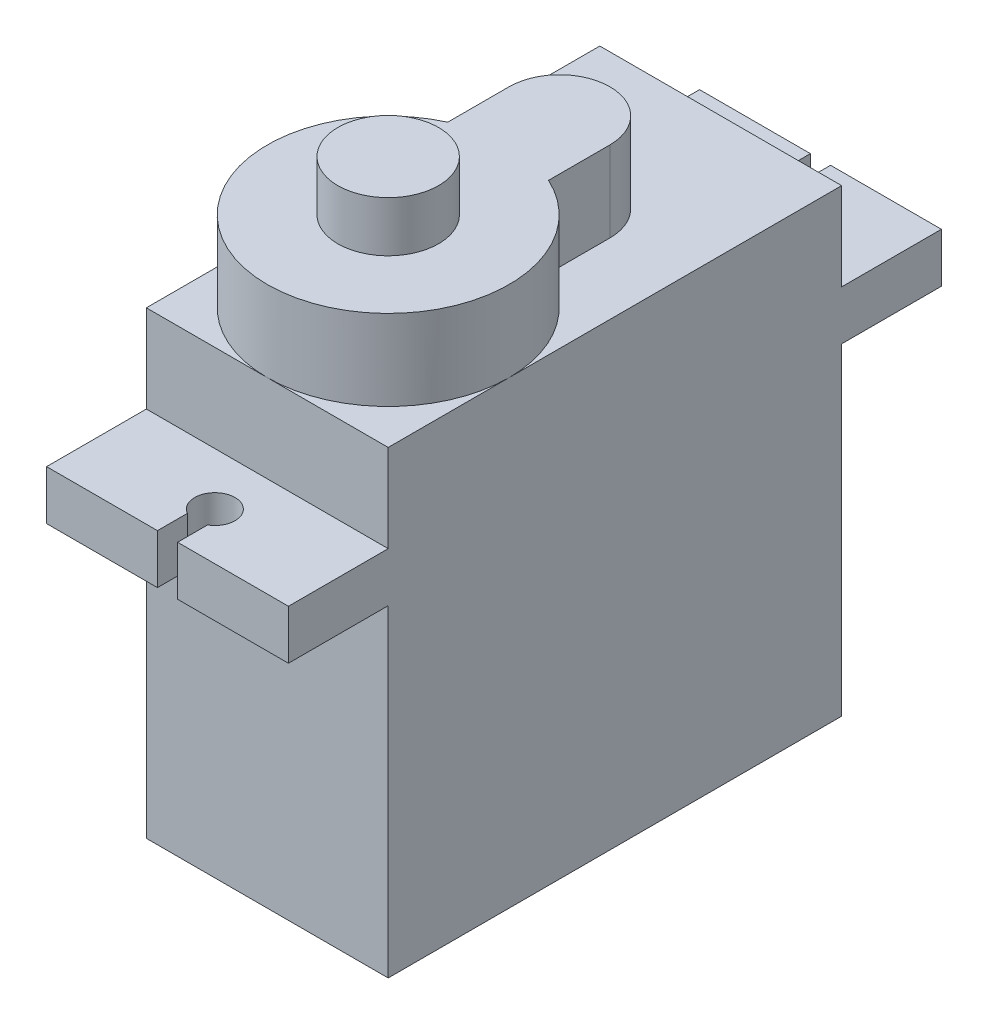
ISO-10303-21;
HEADER;
FILE_DESCRIPTION(('STEP AP214'),'2;1');
FILE_NAME('part.step','',(''),(''),'','','');
FILE_SCHEMA(('AUTOMOTIVE_DESIGN { 1 0 10303 214 1 1 1 1 }'));
ENDSEC;
DATA;
#1=APPLICATION_CONTEXT('core data for automotive mechanical design processes');
#2=APPLICATION_PROTOCOL_DEFINITION('international standard','automotive_design',2000,#1);
#3=PRODUCT_CONTEXT('',#1,'mechanical');
#4=PRODUCT('Part','Part','',(#3));
#5=PRODUCT_RELATED_PRODUCT_CATEGORY('part','',(#4));
#6=PRODUCT_DEFINITION_FORMATION('','',#4);
#7=PRODUCT_DEFINITION_CONTEXT('part definition',#1,'design');
#8=PRODUCT_DEFINITION('design','',#6,#7);
#9=PRODUCT_DEFINITION_SHAPE('','',#8);
#10=(LENGTH_UNIT() NAMED_UNIT(*) SI_UNIT(.MILLI.,.METRE.));
#11=(NAMED_UNIT(*) PLANE_ANGLE_UNIT() SI_UNIT($,.RADIAN.));
#12=(NAMED_UNIT(*) SI_UNIT($,.STERADIAN.) SOLID_ANGLE_UNIT());
#13=UNCERTAINTY_MEASURE_WITH_UNIT(LENGTH_MEASURE(1.E-05),#10,'distance_accuracy_value','');
#14=(GEOMETRIC_REPRESENTATION_CONTEXT(3) GLOBAL_UNCERTAINTY_ASSIGNED_CONTEXT((#13)) GLOBAL_UNIT_ASSIGNED_CONTEXT((#10,
#11,#12)) REPRESENTATION_CONTEXT('',''));
#15=CARTESIAN_POINT('',(0.,0.,0.));
#16=DIRECTION('',(0.,0.,1.));
#17=DIRECTION('',(1.,0.,0.));
#18=AXIS2_PLACEMENT_3D('',#15,#16,#17);
#19=CARTESIAN_POINT('',(12.,22.8,11.25));
#20=DIRECTION('',(0.,-1.,0.));
#21=DIRECTION('',(0.,0.,-1.));
#22=AXIS2_PLACEMENT_3D('',#19,#20,#21);
#23=PLANE('',#22);
#24=CARTESIAN_POINT('',(6.,22.8,5.25));
#25=DIRECTION('',(0.,1.,0.));
#26=DIRECTION('',(0.,0.,1.));
#27=AXIS2_PLACEMENT_3D('',#24,#25,#26);
#28=CIRCLE('',#27,6.);
#29=CARTESIAN_POINT('',(3.5,22.8,-0.204356057317862));
#30=VERTEX_POINT('',#29);
#31=CARTESIAN_POINT('',(0.,22.8,5.25));
#32=VERTEX_POINT('',#31);
#33=EDGE_CURVE('E48',#30,#32,#28,.T.);
#34=ORIENTED_EDGE('',*,*,#33,.F.);
#35=DIRECTION('',(0.,0.,1.));
#36=VECTOR('',#35,1.);
#37=CARTESIAN_POINT('',(3.5,22.8,-3.25));
#38=LINE('',#37,#36);
#39=CARTESIAN_POINT('',(3.5,22.8,-3.25));
#40=VERTEX_POINT('',#39);
#41=EDGE_CURVE('E58',#40,#30,#38,.T.);
#42=ORIENTED_EDGE('',*,*,#41,.F.);
#43=CARTESIAN_POINT('',(6.,22.8,-3.25));
#44=DIRECTION('',(0.,1.,0.));
#45=DIRECTION('',(0.,0.,1.));
#46=AXIS2_PLACEMENT_3D('',#43,#44,#45);
#47=CIRCLE('',#46,2.5);
#48=CARTESIAN_POINT('',(8.5,22.8,-3.25));
#49=VERTEX_POINT('',#48);
#50=EDGE_CURVE('E390',#49,#40,#47,.T.);
#51=ORIENTED_EDGE('',*,*,#50,.F.);
#52=DIRECTION('',(0.,0.,-1.));
#53=VECTOR('',#52,1.);
#54=CARTESIAN_POINT('',(8.5,22.8,-0.204356057317862));
#55=LINE('',#54,#53);
#56=CARTESIAN_POINT('',(8.5,22.8,-0.204356057317862));
#57=VERTEX_POINT('',#56);
#58=EDGE_CURVE('E388',#57,#49,#55,.T.);
#59=ORIENTED_EDGE('',*,*,#58,.F.);
#60=CARTESIAN_POINT('',(12.,22.8,5.25));
#61=VERTEX_POINT('',#60);
#62=EDGE_CURVE('E232',#61,#57,#28,.T.);
#63=ORIENTED_EDGE('',*,*,#62,.F.);
#64=DIRECTION('',(0.,0.,1.));
#65=VECTOR('',#64,1.);
#66=CARTESIAN_POINT('',(12.,22.8,0.));
#67=LINE('',#66,#65);
#68=CARTESIAN_POINT('',(12.,22.8,-11.25));
#69=VERTEX_POINT('',#68);
#70=EDGE_CURVE('E297',#69,#61,#67,.T.);
#71=ORIENTED_EDGE('',*,*,#70,.F.);
#72=DIRECTION('',(-1.,0.,0.));
#73=VECTOR('',#72,1.);
#74=CARTESIAN_POINT('',(12.,22.8,-11.25));
#75=LINE('',#74,#73);
#76=CARTESIAN_POINT('',(0.,22.8,-11.25));
#77=VERTEX_POINT('',#76);
#78=EDGE_CURVE('E360',#69,#77,#75,.T.);
#79=ORIENTED_EDGE('',*,*,#78,.T.);
#80=DIRECTION('',(0.,0.,1.));
#81=VECTOR('',#80,1.);
#82=CARTESIAN_POINT('',(0.,22.8,11.25));
#83=LINE('',#82,#81);
#84=EDGE_CURVE('E325',#77,#32,#83,.T.);
#85=ORIENTED_EDGE('',*,*,#84,.T.);
#86=EDGE_LOOP('',(#34,#42,#51,#59,#63,#71,#79,#85));
#87=FACE_BOUND('',#86,.T.);
#88=ADVANCED_FACE('F37',(#87),#23,.F.);
#89=CARTESIAN_POINT('',(6.,22.8,11.25));
#90=VERTEX_POINT('',#89);
#91=EDGE_CURVE('E11',#32,#90,#28,.T.);
#92=ORIENTED_EDGE('',*,*,#91,.F.);
#93=CARTESIAN_POINT('',(0.,22.8,11.25));
#94=VERTEX_POINT('',#93);
#95=EDGE_CURVE('E324',#32,#94,#83,.T.);
#96=ORIENTED_EDGE('',*,*,#95,.T.);
#97=DIRECTION('',(-1.,0.,0.));
#98=VECTOR('',#97,1.);
#99=CARTESIAN_POINT('',(12.,22.8,11.25));
#100=LINE('',#99,#98);
#101=EDGE_CURVE('E356',#90,#94,#100,.T.);
#102=ORIENTED_EDGE('',*,*,#101,.F.);
#103=EDGE_LOOP('',(#92,#96,#102));
#104=FACE_BOUND('',#103,.T.);
#105=ADVANCED_FACE('F420',(#104),#23,.F.);
#106=EDGE_CURVE('E46',#90,#61,#28,.T.);
#107=ORIENTED_EDGE('',*,*,#106,.F.);
#108=CARTESIAN_POINT('',(12.,22.8,11.25));
#109=VERTEX_POINT('',#108);
#110=EDGE_CURVE('E357',#109,#90,#100,.T.);
#111=ORIENTED_EDGE('',*,*,#110,.F.);
#112=EDGE_CURVE('E296',#61,#109,#67,.T.);
#113=ORIENTED_EDGE('',*,*,#112,.F.);
#114=EDGE_LOOP('',(#107,#111,#113));
#115=FACE_BOUND('',#114,.T.);
#116=ADVANCED_FACE('F422',(#115),#23,.F.);
#117=CARTESIAN_POINT('',(12.,16.,16.2));
#118=DIRECTION('',(0.,0.,-1.));
#119=DIRECTION('',(0.,1.,0.));
#120=AXIS2_PLACEMENT_3D('',#117,#118,#119);
#121=PLANE('',#120);
#122=DIRECTION('',(-1.,0.,0.));
#123=VECTOR('',#122,1.);
#124=CARTESIAN_POINT('',(12.,18.45,16.2));
#125=LINE('',#124,#123);
#126=CARTESIAN_POINT('',(12.,18.45,16.2));
#127=VERTEX_POINT('',#126);
#128=CARTESIAN_POINT('',(6.50000000000001,18.45,16.2));
#129=VERTEX_POINT('',#128);
#130=EDGE_CURVE('E350',#127,#129,#125,.T.);
#131=ORIENTED_EDGE('',*,*,#130,.T.);
#132=DIRECTION('',(0.,1.,0.));
#133=VECTOR('',#132,1.);
#134=CARTESIAN_POINT('',(6.50000000000001,5.85,16.2));
#135=LINE('',#134,#133);
#136=CARTESIAN_POINT('',(6.50000000000001,16.,16.2));
#137=VERTEX_POINT('',#136);
#138=EDGE_CURVE('E250',#137,#129,#135,.T.);
#139=ORIENTED_EDGE('',*,*,#138,.F.);
#140=DIRECTION('',(-1.,0.,0.));
#141=VECTOR('',#140,1.);
#142=CARTESIAN_POINT('',(12.,16.,16.2));
#143=LINE('',#142,#141);
#144=CARTESIAN_POINT('',(12.,16.,16.2));
#145=VERTEX_POINT('',#144);
#146=EDGE_CURVE('E346',#145,#137,#143,.T.);
#147=ORIENTED_EDGE('',*,*,#146,.F.);
#148=DIRECTION('',(0.,-1.,0.));
#149=VECTOR('',#148,1.);
#150=CARTESIAN_POINT('',(12.,16.,16.2));
#151=LINE('',#150,#149);
#152=EDGE_CURVE('E304',#127,#145,#151,.T.);
#153=ORIENTED_EDGE('',*,*,#152,.F.);
#154=EDGE_LOOP('',(#131,#139,#147,#153));
#155=FACE_BOUND('',#154,.T.);
#156=ADVANCED_FACE('F430',(#155),#121,.F.);
#157=CARTESIAN_POINT('',(12.,18.45,-16.2));
#158=DIRECTION('',(0.,0.,1.));
#159=DIRECTION('',(0.,-1.,0.));
#160=AXIS2_PLACEMENT_3D('',#157,#158,#159);
#161=PLANE('',#160);
#162=DIRECTION('',(-1.,0.,0.));
#163=VECTOR('',#162,1.);
#164=CARTESIAN_POINT('',(12.,18.45,-16.2));
#165=LINE('',#164,#163);
#166=CARTESIAN_POINT('',(5.50000000000001,18.45,-16.2));
#167=VERTEX_POINT('',#166);
#168=CARTESIAN_POINT('',(0.,18.45,-16.2));
#169=VERTEX_POINT('',#168);
#170=EDGE_CURVE('E366',#167,#169,#165,.T.);
#171=ORIENTED_EDGE('',*,*,#170,.F.);
#172=DIRECTION('',(0.,1.,0.));
#173=VECTOR('',#172,1.);
#174=CARTESIAN_POINT('',(5.50000000000001,5.85,-16.2));
#175=LINE('',#174,#173);
#176=CARTESIAN_POINT('',(5.50000000000001,16.,-16.2));
#177=VERTEX_POINT('',#176);
#178=EDGE_CURVE('E266',#177,#167,#175,.T.);
#179=ORIENTED_EDGE('',*,*,#178,.F.);
#180=DIRECTION('',(-1.,0.,0.));
#181=VECTOR('',#180,1.);
#182=CARTESIAN_POINT('',(12.,16.,-16.2));
#183=LINE('',#182,#181);
#184=CARTESIAN_POINT('',(0.,16.,-16.2));
#185=VERTEX_POINT('',#184);
#186=EDGE_CURVE('E370',#177,#185,#183,.T.);
#187=ORIENTED_EDGE('',*,*,#186,.T.);
#188=DIRECTION('',(0.,1.,0.));
#189=VECTOR('',#188,1.);
#190=CARTESIAN_POINT('',(0.,18.45,-16.2));
#191=LINE('',#190,#189);
#192=EDGE_CURVE('E316',#185,#169,#191,.T.);
#193=ORIENTED_EDGE('',*,*,#192,.T.);
#194=EDGE_LOOP('',(#171,#179,#187,#193));
#195=FACE_BOUND('',#194,.T.);
#196=ADVANCED_FACE('F435',(#195),#161,.F.);
#197=CARTESIAN_POINT('',(12.,16.,-11.25));
#198=DIRECTION('',(0.,0.,1.));
#199=DIRECTION('',(0.,-1.,0.));
#200=AXIS2_PLACEMENT_3D('',#197,#198,#199);
#201=PLANE('',#200);
#202=DIRECTION('',(0.,1.,0.));
#203=VECTOR('',#202,1.);
#204=CARTESIAN_POINT('',(0.,16.,-11.25));
#205=LINE('',#204,#203);
#206=CARTESIAN_POINT('',(0.,0.,-11.25));
#207=VERTEX_POINT('',#206);
#208=CARTESIAN_POINT('',(0.,16.,-11.25));
#209=VERTEX_POINT('',#208);
#210=EDGE_CURVE('E281',#207,#209,#205,.T.);
#211=ORIENTED_EDGE('',*,*,#210,.T.);
#212=DIRECTION('',(-1.,0.,0.));
#213=VECTOR('',#212,1.);
#214=CARTESIAN_POINT('',(12.,16.,-11.25));
#215=LINE('',#214,#213);
#216=CARTESIAN_POINT('',(12.,16.,-11.25));
#217=VERTEX_POINT('',#216);
#218=EDGE_CURVE('E374',#217,#209,#215,.T.);
#219=ORIENTED_EDGE('',*,*,#218,.F.);
#220=DIRECTION('',(0.,1.,0.));
#221=VECTOR('',#220,1.);
#222=CARTESIAN_POINT('',(12.,16.,-11.25));
#223=LINE('',#222,#221);
#224=CARTESIAN_POINT('',(12.,0.,-11.25));
#225=VERTEX_POINT('',#224);
#226=EDGE_CURVE('E285',#225,#217,#223,.T.);
#227=ORIENTED_EDGE('',*,*,#226,.F.);
#228=DIRECTION('',(-1.,0.,0.));
#229=VECTOR('',#228,1.);
#230=CARTESIAN_POINT('',(12.,0.,-11.25));
#231=LINE('',#230,#229);
#232=EDGE_CURVE('E377',#225,#207,#231,.T.);
#233=ORIENTED_EDGE('',*,*,#232,.T.);
#234=EDGE_LOOP('',(#211,#219,#227,#233));
#235=FACE_BOUND('',#234,.T.);
#236=ADVANCED_FACE('F39',(#235),#201,.F.);
#237=CARTESIAN_POINT('',(12.,16.,-16.2));
#238=DIRECTION('',(0.,1.,0.));
#239=DIRECTION('',(0.,0.,1.));
#240=AXIS2_PLACEMENT_3D('',#237,#238,#239);
#241=PLANE('',#240);
#242=ORIENTED_EDGE('',*,*,#186,.F.);
#243=DIRECTION('',(0.,0.,1.));
#244=VECTOR('',#243,1.);
#245=CARTESIAN_POINT('',(5.50000000000001,16.,-16.2));
#246=LINE('',#245,#244);
#247=CARTESIAN_POINT('',(5.5,16.,-14.7160254037844));
#248=VERTEX_POINT('',#247);
#249=EDGE_CURVE('E275',#177,#248,#246,.T.);
#250=ORIENTED_EDGE('',*,*,#249,.T.);
#251=CARTESIAN_POINT('',(6.00000000000001,16.,-13.85));
#252=DIRECTION('',(0.,1.,0.));
#253=DIRECTION('',(0.,0.,1.));
#254=AXIS2_PLACEMENT_3D('',#251,#252,#253);
#255=CIRCLE('',#254,1.);
#256=CARTESIAN_POINT('',(6.50000000000001,16.,-14.7160254037844));
#257=VERTEX_POINT('',#256);
#258=EDGE_CURVE('E278',#248,#257,#255,.T.);
#259=ORIENTED_EDGE('',*,*,#258,.T.);
#260=DIRECTION('',(0.,0.,-1.));
#261=VECTOR('',#260,1.);
#262=CARTESIAN_POINT('',(6.50000000000001,16.,-16.2));
#263=LINE('',#262,#261);
#264=CARTESIAN_POINT('',(6.50000000000001,16.,-16.2));
#265=VERTEX_POINT('',#264);
#266=EDGE_CURVE('E265',#257,#265,#263,.T.);
#267=ORIENTED_EDGE('',*,*,#266,.T.);
#268=CARTESIAN_POINT('',(12.,16.,-16.2));
#269=VERTEX_POINT('',#268);
#270=EDGE_CURVE('E371',#269,#265,#183,.T.);
#271=ORIENTED_EDGE('',*,*,#270,.F.);
#272=DIRECTION('',(0.,0.,-1.));
#273=VECTOR('',#272,1.);
#274=CARTESIAN_POINT('',(12.,16.,-16.2));
#275=LINE('',#274,#273);
#276=EDGE_CURVE('E288',#217,#269,#275,.T.);
#277=ORIENTED_EDGE('',*,*,#276,.F.);
#278=ORIENTED_EDGE('',*,*,#218,.T.);
#279=DIRECTION('',(0.,0.,-1.));
#280=VECTOR('',#279,1.);
#281=CARTESIAN_POINT('',(0.,16.,-16.2));
#282=LINE('',#281,#280);
#283=EDGE_CURVE('E313',#209,#185,#282,.T.);
#284=ORIENTED_EDGE('',*,*,#283,.T.);
#285=EDGE_LOOP('',(#242,#250,#259,#267,#271,#277,#278,#284));
#286=FACE_BOUND('',#285,.T.);
#287=ADVANCED_FACE('F497',(#286),#241,.F.);
#288=ORIENTED_EDGE('',*,*,#270,.T.);
#289=DIRECTION('',(0.,1.,0.));
#290=VECTOR('',#289,1.);
#291=CARTESIAN_POINT('',(6.50000000000001,5.85,-16.2));
#292=LINE('',#291,#290);
#293=CARTESIAN_POINT('',(6.50000000000001,18.45,-16.2));
#294=VERTEX_POINT('',#293);
#295=EDGE_CURVE('E268',#265,#294,#292,.T.);
#296=ORIENTED_EDGE('',*,*,#295,.T.);
#297=CARTESIAN_POINT('',(12.,18.45,-16.2));
#298=VERTEX_POINT('',#297);
#299=EDGE_CURVE('E367',#298,#294,#165,.T.);
#300=ORIENTED_EDGE('',*,*,#299,.F.);
#301=DIRECTION('',(0.,1.,0.));
#302=VECTOR('',#301,1.);
#303=CARTESIAN_POINT('',(12.,18.45,-16.2));
#304=LINE('',#303,#302);
#305=EDGE_CURVE('E290',#269,#298,#304,.T.);
#306=ORIENTED_EDGE('',*,*,#305,.F.);
#307=EDGE_LOOP('',(#288,#296,#300,#306));
#308=FACE_BOUND('',#307,.T.);
#309=ADVANCED_FACE('F499',(#308),#161,.F.);
#310=CARTESIAN_POINT('',(12.,18.45,-11.25));
#311=DIRECTION('',(0.,-1.,0.));
#312=DIRECTION('',(0.,0.,-1.));
#313=AXIS2_PLACEMENT_3D('',#310,#311,#312);
#314=PLANE('',#313);
#315=CARTESIAN_POINT('',(6.00000000000001,18.45,-13.85));
#316=DIRECTION('',(0.,1.,0.));
#317=DIRECTION('',(0.,0.,1.));
#318=AXIS2_PLACEMENT_3D('',#315,#316,#317);
#319=CIRCLE('',#318,1.);
#320=CARTESIAN_POINT('',(5.5,18.45,-14.7160254037844));
#321=VERTEX_POINT('',#320);
#322=CARTESIAN_POINT('',(6.50000000000001,18.45,-14.7160254037844));
#323=VERTEX_POINT('',#322);
#324=EDGE_CURVE('E249',#321,#323,#319,.T.);
#325=ORIENTED_EDGE('',*,*,#324,.F.);
#326=DIRECTION('',(0.,0.,1.));
#327=VECTOR('',#326,1.);
#328=CARTESIAN_POINT('',(5.50000000000001,18.45,-16.2));
#329=LINE('',#328,#327);
#330=EDGE_CURVE('E259',#167,#321,#329,.T.);
#331=ORIENTED_EDGE('',*,*,#330,.F.);
#332=ORIENTED_EDGE('',*,*,#170,.T.);
#333=DIRECTION('',(0.,0.,1.));
#334=VECTOR('',#333,1.);
#335=CARTESIAN_POINT('',(0.,18.45,-11.25));
#336=LINE('',#335,#334);
#337=CARTESIAN_POINT('',(0.,18.45,-11.25));
#338=VERTEX_POINT('',#337);
#339=EDGE_CURVE('E319',#169,#338,#336,.T.);
#340=ORIENTED_EDGE('',*,*,#339,.T.);
#341=DIRECTION('',(-1.,0.,0.));
#342=VECTOR('',#341,1.);
#343=CARTESIAN_POINT('',(12.,18.45,-11.25));
#344=LINE('',#343,#342);
#345=CARTESIAN_POINT('',(12.,18.45,-11.25));
#346=VERTEX_POINT('',#345);
#347=EDGE_CURVE('E363',#346,#338,#344,.T.);
#348=ORIENTED_EDGE('',*,*,#347,.F.);
#349=DIRECTION('',(0.,0.,1.));
#350=VECTOR('',#349,1.);
#351=CARTESIAN_POINT('',(12.,18.45,-11.25));
#352=LINE('',#351,#350);
#353=EDGE_CURVE('E292',#298,#346,#352,.T.);
#354=ORIENTED_EDGE('',*,*,#353,.F.);
#355=ORIENTED_EDGE('',*,*,#299,.T.);
#356=DIRECTION('',(0.,0.,-1.));
#357=VECTOR('',#356,1.);
#358=CARTESIAN_POINT('',(6.50000000000001,18.45,-14.7160254037844));
#359=LINE('',#358,#357);
#360=EDGE_CURVE('E257',#323,#294,#359,.T.);
#361=ORIENTED_EDGE('',*,*,#360,.F.);
#362=EDGE_LOOP('',(#325,#331,#332,#340,#348,#354,#355,#361));
#363=FACE_BOUND('',#362,.T.);
#364=ADVANCED_FACE('F504',(#363),#314,.F.);
#365=CARTESIAN_POINT('',(12.,22.8,-11.25));
#366=DIRECTION('',(0.,0.,1.));
#367=DIRECTION('',(1.,0.,0.));
#368=AXIS2_PLACEMENT_3D('',#365,#366,#367);
#369=PLANE('',#368);
#370=DIRECTION('',(0.,1.,0.));
#371=VECTOR('',#370,1.);
#372=CARTESIAN_POINT('',(0.,22.8,-11.25));
#373=LINE('',#372,#371);
#374=EDGE_CURVE('E321',#338,#77,#373,.T.);
#375=ORIENTED_EDGE('',*,*,#374,.T.);
#376=ORIENTED_EDGE('',*,*,#78,.F.);
#377=DIRECTION('',(0.,1.,0.));
#378=VECTOR('',#377,1.);
#379=CARTESIAN_POINT('',(12.,22.8,-11.25));
#380=LINE('',#379,#378);
#381=EDGE_CURVE('E294',#346,#69,#380,.T.);
#382=ORIENTED_EDGE('',*,*,#381,.F.);
#383=ORIENTED_EDGE('',*,*,#347,.T.);
#384=EDGE_LOOP('',(#375,#376,#382,#383));
#385=FACE_BOUND('',#384,.T.);
#386=ADVANCED_FACE('F457',(#385),#369,.F.);
#387=CARTESIAN_POINT('',(12.,18.45,11.25));
#388=DIRECTION('',(0.,0.,-1.));
#389=DIRECTION('',(-1.,0.,0.));
#390=AXIS2_PLACEMENT_3D('',#387,#388,#389);
#391=PLANE('',#390);
#392=DIRECTION('',(0.,-1.,0.));
#393=VECTOR('',#392,1.);
#394=CARTESIAN_POINT('',(0.,18.45,11.25));
#395=LINE('',#394,#393);
#396=CARTESIAN_POINT('',(0.,18.45,11.25));
#397=VERTEX_POINT('',#396);
#398=EDGE_CURVE('E327',#94,#397,#395,.T.);
#399=ORIENTED_EDGE('',*,*,#398,.T.);
#400=DIRECTION('',(-1.,0.,0.));
#401=VECTOR('',#400,1.);
#402=CARTESIAN_POINT('',(12.,18.45,11.25));
#403=LINE('',#402,#401);
#404=CARTESIAN_POINT('',(12.,18.45,11.25));
#405=VERTEX_POINT('',#404);
#406=EDGE_CURVE('E353',#405,#397,#403,.T.);
#407=ORIENTED_EDGE('',*,*,#406,.F.);
#408=DIRECTION('',(0.,-1.,0.));
#409=VECTOR('',#408,1.);
#410=CARTESIAN_POINT('',(12.,18.45,11.25));
#411=LINE('',#410,#409);
#412=EDGE_CURVE('E300',#109,#405,#411,.T.);
#413=ORIENTED_EDGE('',*,*,#412,.F.);
#414=ORIENTED_EDGE('',*,*,#110,.T.);
#415=ORIENTED_EDGE('',*,*,#101,.T.);
#416=EDGE_LOOP('',(#399,#407,#413,#414,#415));
#417=FACE_BOUND('',#416,.T.);
#418=ADVANCED_FACE('F447',(#417),#391,.F.);
#419=CARTESIAN_POINT('',(12.,18.45,16.2));
#420=DIRECTION('',(0.,-1.,0.));
#421=DIRECTION('',(0.,0.,-1.));
#422=AXIS2_PLACEMENT_3D('',#419,#420,#421);
#423=PLANE('',#422);
#424=CARTESIAN_POINT('',(6.00000000000001,18.45,13.85));
#425=DIRECTION('',(0.,1.,0.));
#426=DIRECTION('',(0.,0.,1.));
#427=AXIS2_PLACEMENT_3D('',#424,#425,#426);
#428=CIRCLE('',#427,0.999999999999999);
#429=CARTESIAN_POINT('',(6.50000000000001,18.45,14.7160254037844));
#430=VERTEX_POINT('',#429);
#431=CARTESIAN_POINT('',(5.50000000000001,18.45,14.7160254037844));
#432=VERTEX_POINT('',#431);
#433=EDGE_CURVE('E233',#430,#432,#428,.T.);
#434=ORIENTED_EDGE('',*,*,#433,.F.);
#435=DIRECTION('',(0.,0.,-1.));
#436=VECTOR('',#435,1.);
#437=CARTESIAN_POINT('',(6.50000000000001,18.45,14.7160254037844));
#438=LINE('',#437,#436);
#439=EDGE_CURVE('E243',#129,#430,#438,.T.);
#440=ORIENTED_EDGE('',*,*,#439,.F.);
#441=ORIENTED_EDGE('',*,*,#130,.F.);
#442=DIRECTION('',(0.,0.,1.));
#443=VECTOR('',#442,1.);
#444=CARTESIAN_POINT('',(12.,18.45,16.2));
#445=LINE('',#444,#443);
#446=EDGE_CURVE('E302',#405,#127,#445,.T.);
#447=ORIENTED_EDGE('',*,*,#446,.F.);
#448=ORIENTED_EDGE('',*,*,#406,.T.);
#449=DIRECTION('',(0.,0.,1.));
#450=VECTOR('',#449,1.);
#451=CARTESIAN_POINT('',(0.,18.45,16.2));
#452=LINE('',#451,#450);
#453=CARTESIAN_POINT('',(0.,18.45,16.2));
#454=VERTEX_POINT('',#453);
#455=EDGE_CURVE('E329',#397,#454,#452,.T.);
#456=ORIENTED_EDGE('',*,*,#455,.T.);
#457=CARTESIAN_POINT('',(5.50000000000001,18.45,16.2));
#458=VERTEX_POINT('',#457);
#459=EDGE_CURVE('E349',#458,#454,#125,.T.);
#460=ORIENTED_EDGE('',*,*,#459,.F.);
#461=DIRECTION('',(0.,0.,1.));
#462=VECTOR('',#461,1.);
#463=CARTESIAN_POINT('',(5.50000000000001,18.45,16.2));
#464=LINE('',#463,#462);
#465=EDGE_CURVE('E236',#432,#458,#464,.T.);
#466=ORIENTED_EDGE('',*,*,#465,.F.);
#467=EDGE_LOOP('',(#434,#440,#441,#447,#448,#456,#460,#466));
#468=FACE_BOUND('',#467,.T.);
#469=ADVANCED_FACE('F469',(#468),#423,.F.);
#470=CARTESIAN_POINT('',(5.50000000000001,16.,16.2));
#471=VERTEX_POINT('',#470);
#472=CARTESIAN_POINT('',(0.,16.,16.2));
#473=VERTEX_POINT('',#472);
#474=EDGE_CURVE('E345',#471,#473,#143,.T.);
#475=ORIENTED_EDGE('',*,*,#474,.F.);
#476=DIRECTION('',(0.,1.,0.));
#477=VECTOR('',#476,1.);
#478=CARTESIAN_POINT('',(5.50000000000001,5.85,16.2));
#479=LINE('',#478,#477);
#480=EDGE_CURVE('E252',#471,#458,#479,.T.);
#481=ORIENTED_EDGE('',*,*,#480,.T.);
#482=ORIENTED_EDGE('',*,*,#459,.T.);
#483=DIRECTION('',(0.,-1.,0.));
#484=VECTOR('',#483,1.);
#485=CARTESIAN_POINT('',(0.,16.,16.2));
#486=LINE('',#485,#484);
#487=EDGE_CURVE('E332',#454,#473,#486,.T.);
#488=ORIENTED_EDGE('',*,*,#487,.T.);
#489=EDGE_LOOP('',(#475,#481,#482,#488));
#490=FACE_BOUND('',#489,.T.);
#491=ADVANCED_FACE('F438',(#490),#121,.F.);
#492=CARTESIAN_POINT('',(12.,16.,11.25));
#493=DIRECTION('',(0.,1.,0.));
#494=DIRECTION('',(0.,0.,1.));
#495=AXIS2_PLACEMENT_3D('',#492,#493,#494);
#496=PLANE('',#495);
#497=ORIENTED_EDGE('',*,*,#146,.T.);
#498=DIRECTION('',(0.,0.,-1.));
#499=VECTOR('',#498,1.);
#500=CARTESIAN_POINT('',(6.50000000000001,16.,11.25));
#501=LINE('',#500,#499);
#502=CARTESIAN_POINT('',(6.50000000000001,16.,14.7160254037844));
#503=VERTEX_POINT('',#502);
#504=EDGE_CURVE('E41',#137,#503,#501,.T.);
#505=ORIENTED_EDGE('',*,*,#504,.T.);
#506=CARTESIAN_POINT('',(6.00000000000001,16.,13.85));
#507=DIRECTION('',(0.,1.,0.));
#508=DIRECTION('',(0.,0.,1.));
#509=AXIS2_PLACEMENT_3D('',#506,#507,#508);
#510=CIRCLE('',#509,0.999999999999999);
#511=CARTESIAN_POINT('',(5.50000000000001,16.,14.7160254037844));
#512=VERTEX_POINT('',#511);
#513=EDGE_CURVE('E382',#503,#512,#510,.T.);
#514=ORIENTED_EDGE('',*,*,#513,.T.);
#515=DIRECTION('',(0.,0.,1.));
#516=VECTOR('',#515,1.);
#517=CARTESIAN_POINT('',(5.50000000000001,16.,11.25));
#518=LINE('',#517,#516);
#519=EDGE_CURVE('E380',#512,#471,#518,.T.);
#520=ORIENTED_EDGE('',*,*,#519,.T.);
#521=ORIENTED_EDGE('',*,*,#474,.T.);
#522=DIRECTION('',(0.,0.,-1.));
#523=VECTOR('',#522,1.);
#524=CARTESIAN_POINT('',(0.,16.,11.25));
#525=LINE('',#524,#523);
#526=CARTESIAN_POINT('',(0.,16.,11.25));
#527=VERTEX_POINT('',#526);
#528=EDGE_CURVE('E335',#473,#527,#525,.T.);
#529=ORIENTED_EDGE('',*,*,#528,.T.);
#530=DIRECTION('',(-1.,0.,0.));
#531=VECTOR('',#530,1.);
#532=CARTESIAN_POINT('',(12.,16.,11.25));
#533=LINE('',#532,#531);
#534=CARTESIAN_POINT('',(12.,16.,11.25));
#535=VERTEX_POINT('',#534);
#536=EDGE_CURVE('E342',#535,#527,#533,.T.);
#537=ORIENTED_EDGE('',*,*,#536,.F.);
#538=DIRECTION('',(0.,0.,-1.));
#539=VECTOR('',#538,1.);
#540=CARTESIAN_POINT('',(12.,16.,11.25));
#541=LINE('',#540,#539);
#542=EDGE_CURVE('E306',#145,#535,#541,.T.);
#543=ORIENTED_EDGE('',*,*,#542,.F.);
#544=EDGE_LOOP('',(#497,#505,#514,#520,#521,#529,#537,#543));
#545=FACE_BOUND('',#544,.T.);
#546=ADVANCED_FACE('F479',(#545),#496,.F.);
#547=CARTESIAN_POINT('',(12.,0.,11.25));
#548=DIRECTION('',(0.,0.,-1.));
#549=DIRECTION('',(0.,1.,0.));
#550=AXIS2_PLACEMENT_3D('',#547,#548,#549);
#551=PLANE('',#550);
#552=DIRECTION('',(0.,-1.,0.));
#553=VECTOR('',#552,1.);
#554=CARTESIAN_POINT('',(0.,0.,11.25));
#555=LINE('',#554,#553);
#556=CARTESIAN_POINT('',(0.,0.,11.25));
#557=VERTEX_POINT('',#556);
#558=EDGE_CURVE('E337',#527,#557,#555,.T.);
#559=ORIENTED_EDGE('',*,*,#558,.T.);
#560=DIRECTION('',(-1.,0.,0.));
#561=VECTOR('',#560,1.);
#562=CARTESIAN_POINT('',(12.,0.,11.25));
#563=LINE('',#562,#561);
#564=CARTESIAN_POINT('',(12.,0.,11.25));
#565=VERTEX_POINT('',#564);
#566=EDGE_CURVE('E311',#565,#557,#563,.T.);
#567=ORIENTED_EDGE('',*,*,#566,.F.);
#568=DIRECTION('',(0.,-1.,0.));
#569=VECTOR('',#568,1.);
#570=CARTESIAN_POINT('',(12.,0.,11.25));
#571=LINE('',#570,#569);
#572=EDGE_CURVE('E308',#535,#565,#571,.T.);
#573=ORIENTED_EDGE('',*,*,#572,.F.);
#574=ORIENTED_EDGE('',*,*,#536,.T.);
#575=EDGE_LOOP('',(#559,#567,#573,#574));
#576=FACE_BOUND('',#575,.T.);
#577=ADVANCED_FACE('F483',(#576),#551,.F.);
#578=CARTESIAN_POINT('',(12.,0.,0.));
#579=DIRECTION('',(0.,1.,0.));
#580=DIRECTION('',(0.,0.,1.));
#581=AXIS2_PLACEMENT_3D('',#578,#579,#580);
#582=PLANE('',#581);
#583=DIRECTION('',(0.,0.,-1.));
#584=VECTOR('',#583,1.);
#585=CARTESIAN_POINT('',(0.,0.,0.));
#586=LINE('',#585,#584);
#587=EDGE_CURVE('E286',#557,#207,#586,.T.);
#588=ORIENTED_EDGE('',*,*,#587,.T.);
#589=ORIENTED_EDGE('',*,*,#232,.F.);
#590=DIRECTION('',(0.,0.,-1.));
#591=VECTOR('',#590,1.);
#592=CARTESIAN_POINT('',(12.,0.,-11.25));
#593=LINE('',#592,#591);
#594=EDGE_CURVE('E282',#565,#225,#593,.T.);
#595=ORIENTED_EDGE('',*,*,#594,.F.);
#596=ORIENTED_EDGE('',*,*,#566,.T.);
#597=EDGE_LOOP('',(#588,#589,#595,#596));
#598=FACE_BOUND('',#597,.T.);
#599=ADVANCED_FACE('F486',(#598),#582,.F.);
#600=CARTESIAN_POINT('',(12.,0.,0.));
#601=DIRECTION('',(-1.,0.,0.));
#602=DIRECTION('',(0.,0.,1.));
#603=AXIS2_PLACEMENT_3D('',#600,#601,#602);
#604=PLANE('',#603);
#605=ORIENTED_EDGE('',*,*,#594,.T.);
#606=ORIENTED_EDGE('',*,*,#226,.T.);
#607=ORIENTED_EDGE('',*,*,#276,.T.);
#608=ORIENTED_EDGE('',*,*,#305,.T.);
#609=ORIENTED_EDGE('',*,*,#353,.T.);
#610=ORIENTED_EDGE('',*,*,#381,.T.);
#611=ORIENTED_EDGE('',*,*,#70,.T.);
#612=ORIENTED_EDGE('',*,*,#112,.T.);
#613=ORIENTED_EDGE('',*,*,#412,.T.);
#614=ORIENTED_EDGE('',*,*,#446,.T.);
#615=ORIENTED_EDGE('',*,*,#152,.T.);
#616=ORIENTED_EDGE('',*,*,#542,.T.);
#617=ORIENTED_EDGE('',*,*,#572,.T.);
#618=EDGE_LOOP('',(#605,#606,#607,#608,#609,#610,#611,#612,#613,#614,#615,#616,#617));
#619=FACE_BOUND('',#618,.T.);
#620=ADVANCED_FACE('F451',(#619),#604,.F.);
#621=CARTESIAN_POINT('',(0.,0.,0.));
#622=DIRECTION('',(-1.,0.,0.));
#623=DIRECTION('',(0.,0.,1.));
#624=AXIS2_PLACEMENT_3D('',#621,#622,#623);
#625=PLANE('',#624);
#626=ORIENTED_EDGE('',*,*,#210,.F.);
#627=ORIENTED_EDGE('',*,*,#587,.F.);
#628=ORIENTED_EDGE('',*,*,#558,.F.);
#629=ORIENTED_EDGE('',*,*,#528,.F.);
#630=ORIENTED_EDGE('',*,*,#487,.F.);
#631=ORIENTED_EDGE('',*,*,#455,.F.);
#632=ORIENTED_EDGE('',*,*,#398,.F.);
#633=ORIENTED_EDGE('',*,*,#95,.F.);
#634=ORIENTED_EDGE('',*,*,#84,.F.);
#635=ORIENTED_EDGE('',*,*,#374,.F.);
#636=ORIENTED_EDGE('',*,*,#339,.F.);
#637=ORIENTED_EDGE('',*,*,#192,.F.);
#638=ORIENTED_EDGE('',*,*,#283,.F.);
#639=EDGE_LOOP('',(#626,#627,#628,#629,#630,#631,#632,#633,#634,#635,#636,#637,#638));
#640=FACE_BOUND('',#639,.T.);
#641=ADVANCED_FACE('F463',(#640),#625,.T.);
#642=CARTESIAN_POINT('',(6.00000000000001,5.85,-13.85));
#643=DIRECTION('',(0.,1.,0.));
#644=DIRECTION('',(0.,0.,1.));
#645=AXIS2_PLACEMENT_3D('',#642,#643,#644);
#646=CYLINDRICAL_SURFACE('',#645,1.);
#647=DIRECTION('',(0.,1.,0.));
#648=VECTOR('',#647,1.);
#649=CARTESIAN_POINT('',(5.5,5.85,-14.7160254037844));
#650=LINE('',#649,#648);
#651=EDGE_CURVE('E263',#248,#321,#650,.T.);
#652=ORIENTED_EDGE('',*,*,#651,.T.);
#653=ORIENTED_EDGE('',*,*,#324,.T.);
#654=DIRECTION('',(0.,1.,0.));
#655=VECTOR('',#654,1.);
#656=CARTESIAN_POINT('',(6.50000000000001,5.85,-14.7160254037844));
#657=LINE('',#656,#655);
#658=EDGE_CURVE('E262',#257,#323,#657,.T.);
#659=ORIENTED_EDGE('',*,*,#658,.F.);
#660=ORIENTED_EDGE('',*,*,#258,.F.);
#661=EDGE_LOOP('',(#652,#653,#659,#660));
#662=FACE_BOUND('',#661,.T.);
#663=ADVANCED_FACE('F513',(#662),#646,.F.);
#664=CARTESIAN_POINT('',(5.50000000000001,5.85,-16.2));
#665=DIRECTION('',(-1.,0.,0.));
#666=DIRECTION('',(0.,0.,1.));
#667=AXIS2_PLACEMENT_3D('',#664,#665,#666);
#668=PLANE('',#667);
#669=ORIENTED_EDGE('',*,*,#178,.T.);
#670=ORIENTED_EDGE('',*,*,#330,.T.);
#671=ORIENTED_EDGE('',*,*,#651,.F.);
#672=ORIENTED_EDGE('',*,*,#249,.F.);
#673=EDGE_LOOP('',(#669,#670,#671,#672));
#674=FACE_BOUND('',#673,.T.);
#675=ADVANCED_FACE('F511',(#674),#668,.F.);
#676=CARTESIAN_POINT('',(6.50000000000001,5.85,-14.7160254037844));
#677=DIRECTION('',(1.,0.,0.));
#678=DIRECTION('',(0.,0.,-1.));
#679=AXIS2_PLACEMENT_3D('',#676,#677,#678);
#680=PLANE('',#679);
#681=ORIENTED_EDGE('',*,*,#658,.T.);
#682=ORIENTED_EDGE('',*,*,#360,.T.);
#683=ORIENTED_EDGE('',*,*,#295,.F.);
#684=ORIENTED_EDGE('',*,*,#266,.F.);
#685=EDGE_LOOP('',(#681,#682,#683,#684));
#686=FACE_BOUND('',#685,.T.);
#687=ADVANCED_FACE('F516',(#686),#680,.F.);
#688=CARTESIAN_POINT('',(6.00000000000001,5.85,13.85));
#689=DIRECTION('',(0.,1.,0.));
#690=DIRECTION('',(0.,0.,1.));
#691=AXIS2_PLACEMENT_3D('',#688,#689,#690);
#692=CYLINDRICAL_SURFACE('',#691,0.999999999999999);
#693=DIRECTION('',(0.,1.,0.));
#694=VECTOR('',#693,1.);
#695=CARTESIAN_POINT('',(6.50000000000001,5.85,14.7160254037844));
#696=LINE('',#695,#694);
#697=EDGE_CURVE('E247',#503,#430,#696,.T.);
#698=ORIENTED_EDGE('',*,*,#697,.T.);
#699=ORIENTED_EDGE('',*,*,#433,.T.);
#700=DIRECTION('',(0.,1.,0.));
#701=VECTOR('',#700,1.);
#702=CARTESIAN_POINT('',(5.50000000000001,5.85,14.7160254037844));
#703=LINE('',#702,#701);
#704=EDGE_CURVE('E246',#512,#432,#703,.T.);
#705=ORIENTED_EDGE('',*,*,#704,.F.);
#706=ORIENTED_EDGE('',*,*,#513,.F.);
#707=EDGE_LOOP('',(#698,#699,#705,#706));
#708=FACE_BOUND('',#707,.T.);
#709=ADVANCED_FACE('F518',(#708),#692,.F.);
#710=CARTESIAN_POINT('',(6.50000000000001,5.85,14.7160254037844));
#711=DIRECTION('',(1.,0.,0.));
#712=DIRECTION('',(0.,0.,-1.));
#713=AXIS2_PLACEMENT_3D('',#710,#711,#712);
#714=PLANE('',#713);
#715=ORIENTED_EDGE('',*,*,#138,.T.);
#716=ORIENTED_EDGE('',*,*,#439,.T.);
#717=ORIENTED_EDGE('',*,*,#697,.F.);
#718=ORIENTED_EDGE('',*,*,#504,.F.);
#719=EDGE_LOOP('',(#715,#716,#717,#718));
#720=FACE_BOUND('',#719,.T.);
#721=ADVANCED_FACE('F524',(#720),#714,.F.);
#722=CARTESIAN_POINT('',(5.50000000000001,5.85,16.2));
#723=DIRECTION('',(-1.,0.,0.));
#724=DIRECTION('',(0.,0.,1.));
#725=AXIS2_PLACEMENT_3D('',#722,#723,#724);
#726=PLANE('',#725);
#727=ORIENTED_EDGE('',*,*,#704,.T.);
#728=ORIENTED_EDGE('',*,*,#465,.T.);
#729=ORIENTED_EDGE('',*,*,#480,.F.);
#730=ORIENTED_EDGE('',*,*,#519,.F.);
#731=EDGE_LOOP('',(#727,#728,#729,#730));
#732=FACE_BOUND('',#731,.T.);
#733=ADVANCED_FACE('F655',(#732),#726,.F.);
#734=CARTESIAN_POINT('',(6.,26.8,5.25));
#735=DIRECTION('',(0.,-1.,0.));
#736=DIRECTION('',(0.,0.,-1.));
#737=AXIS2_PLACEMENT_3D('',#734,#735,#736);
#738=CYLINDRICAL_SURFACE('',#737,6.);
#739=ORIENTED_EDGE('',*,*,#33,.T.);
#740=ORIENTED_EDGE('',*,*,#91,.T.);
#741=ORIENTED_EDGE('',*,*,#106,.T.);
#742=ORIENTED_EDGE('',*,*,#62,.T.);
#743=DIRECTION('',(0.,-1.,0.));
#744=VECTOR('',#743,1.);
#745=CARTESIAN_POINT('',(8.5,26.8,-0.204356057317862));
#746=LINE('',#745,#744);
#747=CARTESIAN_POINT('',(8.5,26.8,-0.204356057317862));
#748=VERTEX_POINT('',#747);
#749=EDGE_CURVE('E213',#748,#57,#746,.T.);
#750=ORIENTED_EDGE('',*,*,#749,.F.);
#751=CARTESIAN_POINT('',(6.,26.8,5.25));
#752=DIRECTION('',(0.,1.,0.));
#753=DIRECTION('',(0.,0.,1.));
#754=AXIS2_PLACEMENT_3D('',#751,#752,#753);
#755=CIRCLE('',#754,6.);
#756=CARTESIAN_POINT('',(3.5,26.8,-0.204356057317862));
#757=VERTEX_POINT('',#756);
#758=EDGE_CURVE('E219',#757,#748,#755,.T.);
#759=ORIENTED_EDGE('',*,*,#758,.F.);
#760=DIRECTION('',(0.,-1.,0.));
#761=VECTOR('',#760,1.);
#762=CARTESIAN_POINT('',(3.5,26.8,-0.204356057317862));
#763=LINE('',#762,#761);
#764=EDGE_CURVE('E399',#757,#30,#763,.T.);
#765=ORIENTED_EDGE('',*,*,#764,.T.);
#766=EDGE_LOOP('',(#739,#740,#741,#742,#750,#759,#765));
#767=FACE_BOUND('',#766,.T.);
#768=ADVANCED_FACE('F230',(#767),#738,.T.);
#769=CARTESIAN_POINT('',(8.5,26.8,-0.204356057317862));
#770=DIRECTION('',(-1.,0.,0.));
#771=DIRECTION('',(0.,0.,1.));
#772=AXIS2_PLACEMENT_3D('',#769,#770,#771);
#773=PLANE('',#772);
#774=ORIENTED_EDGE('',*,*,#58,.T.);
#775=DIRECTION('',(0.,-1.,0.));
#776=VECTOR('',#775,1.);
#777=CARTESIAN_POINT('',(8.5,26.8,-3.25));
#778=LINE('',#777,#776);
#779=CARTESIAN_POINT('',(8.5,26.8,-3.25));
#780=VERTEX_POINT('',#779);
#781=EDGE_CURVE('E215',#780,#49,#778,.T.);
#782=ORIENTED_EDGE('',*,*,#781,.F.);
#783=DIRECTION('',(0.,0.,-1.));
#784=VECTOR('',#783,1.);
#785=CARTESIAN_POINT('',(8.5,26.8,-0.204356057317862));
#786=LINE('',#785,#784);
#787=EDGE_CURVE('E208',#748,#780,#786,.T.);
#788=ORIENTED_EDGE('',*,*,#787,.F.);
#789=ORIENTED_EDGE('',*,*,#749,.T.);
#790=EDGE_LOOP('',(#774,#782,#788,#789));
#791=FACE_BOUND('',#790,.T.);
#792=ADVANCED_FACE('F211',(#791),#773,.F.);
#793=CARTESIAN_POINT('',(6.,26.8,-3.25));
#794=DIRECTION('',(0.,-1.,0.));
#795=DIRECTION('',(0.,0.,-1.));
#796=AXIS2_PLACEMENT_3D('',#793,#794,#795);
#797=CYLINDRICAL_SURFACE('',#796,2.5);
#798=ORIENTED_EDGE('',*,*,#50,.T.);
#799=DIRECTION('',(0.,-1.,0.));
#800=VECTOR('',#799,1.);
#801=CARTESIAN_POINT('',(3.5,26.8,-3.25));
#802=LINE('',#801,#800);
#803=CARTESIAN_POINT('',(3.5,26.8,-3.25));
#804=VERTEX_POINT('',#803);
#805=EDGE_CURVE('E238',#804,#40,#802,.T.);
#806=ORIENTED_EDGE('',*,*,#805,.F.);
#807=CARTESIAN_POINT('',(6.,26.8,-3.25));
#808=DIRECTION('',(0.,1.,0.));
#809=DIRECTION('',(0.,0.,1.));
#810=AXIS2_PLACEMENT_3D('',#807,#808,#809);
#811=CIRCLE('',#810,2.5);
#812=EDGE_CURVE('E218',#780,#804,#811,.T.);
#813=ORIENTED_EDGE('',*,*,#812,.F.);
#814=ORIENTED_EDGE('',*,*,#781,.T.);
#815=EDGE_LOOP('',(#798,#806,#813,#814));
#816=FACE_BOUND('',#815,.T.);
#817=ADVANCED_FACE('F406',(#816),#797,.T.);
#818=CARTESIAN_POINT('',(3.5,26.8,-3.25));
#819=DIRECTION('',(1.,0.,0.));
#820=DIRECTION('',(0.,0.,-1.));
#821=AXIS2_PLACEMENT_3D('',#818,#819,#820);
#822=PLANE('',#821);
#823=ORIENTED_EDGE('',*,*,#41,.T.);
#824=ORIENTED_EDGE('',*,*,#764,.F.);
#825=DIRECTION('',(0.,0.,1.));
#826=VECTOR('',#825,1.);
#827=CARTESIAN_POINT('',(3.5,26.8,-3.25));
#828=LINE('',#827,#826);
#829=EDGE_CURVE('E224',#804,#757,#828,.T.);
#830=ORIENTED_EDGE('',*,*,#829,.F.);
#831=ORIENTED_EDGE('',*,*,#805,.T.);
#832=EDGE_LOOP('',(#823,#824,#830,#831));
#833=FACE_BOUND('',#832,.T.);
#834=ADVANCED_FACE('F408',(#833),#822,.F.);
#835=CARTESIAN_POINT('',(6.,26.8,5.25));
#836=DIRECTION('',(0.,1.,0.));
#837=DIRECTION('',(0.,0.,1.));
#838=AXIS2_PLACEMENT_3D('',#835,#836,#837);
#839=PLANE('',#838);
#840=CARTESIAN_POINT('',(6.,26.8,5.25));
#841=DIRECTION('',(0.,1.,0.));
#842=DIRECTION('',(0.,0.,1.));
#843=AXIS2_PLACEMENT_3D('',#840,#841,#842);
#844=CIRCLE('',#843,2.5);
#845=CARTESIAN_POINT('',(6.,26.8,7.75));
#846=VERTEX_POINT('',#845);
#847=EDGE_CURVE('E392',#846,#846,#844,.T.);
#848=ORIENTED_EDGE('',*,*,#847,.F.);
#849=EDGE_LOOP('',(#848));
#850=FACE_BOUND('',#849,.T.);
#851=ORIENTED_EDGE('',*,*,#758,.T.);
#852=ORIENTED_EDGE('',*,*,#787,.T.);
#853=ORIENTED_EDGE('',*,*,#812,.T.);
#854=ORIENTED_EDGE('',*,*,#829,.T.);
#855=EDGE_LOOP('',(#851,#852,#853,#854));
#856=FACE_BOUND('',#855,.T.);
#857=ADVANCED_FACE('F222',(#850,#856),#839,.T.);
#858=CARTESIAN_POINT('',(6.,29.3,5.25));
#859=DIRECTION('',(0.,-1.,0.));
#860=DIRECTION('',(0.,0.,-1.));
#861=AXIS2_PLACEMENT_3D('',#858,#859,#860);
#862=CYLINDRICAL_SURFACE('',#861,2.5);
#863=CARTESIAN_POINT('',(6.,29.3,5.25));
#864=DIRECTION('',(0.,1.,0.));
#865=DIRECTION('',(0.,0.,1.));
#866=AXIS2_PLACEMENT_3D('',#863,#864,#865);
#867=CIRCLE('',#866,2.5);
#868=CARTESIAN_POINT('',(6.,29.3,7.75));
#869=VERTEX_POINT('',#868);
#870=EDGE_CURVE('E389',#869,#869,#867,.T.);
#871=ORIENTED_EDGE('',*,*,#870,.F.);
#872=EDGE_LOOP('',(#871));
#873=FACE_BOUND('',#872,.T.);
#874=ORIENTED_EDGE('',*,*,#847,.T.);
#875=EDGE_LOOP('',(#874));
#876=FACE_BOUND('',#875,.T.);
#877=ADVANCED_FACE('F415',(#873,#876),#862,.T.);
#878=CARTESIAN_POINT('',(6.,29.3,5.25));
#879=DIRECTION('',(0.,1.,0.));
#880=DIRECTION('',(0.,0.,1.));
#881=AXIS2_PLACEMENT_3D('',#878,#879,#880);
#882=PLANE('',#881);
#883=ORIENTED_EDGE('',*,*,#870,.T.);
#884=EDGE_LOOP('',(#883));
#885=FACE_BOUND('',#884,.T.);
#886=ADVANCED_FACE('F737',(#885),#882,.T.);
#887=CLOSED_SHELL('',(#88,#105,#116,#156,#196,#236,#287,#309,#364,#386,#418,#469,#491,#546,#577,
#599,#620,#641,#663,#675,#687,#709,#721,#733,#768,#792,#817,#834,#857,#877,#886));
#888=MANIFOLD_SOLID_BREP('B2',#887);
#889=ADVANCED_BREP_SHAPE_REPRESENTATION('',(#18,#888),#14);
#890=SHAPE_DEFINITION_REPRESENTATION(#9,#889);
ENDSEC;
END-ISO-10303-21;
